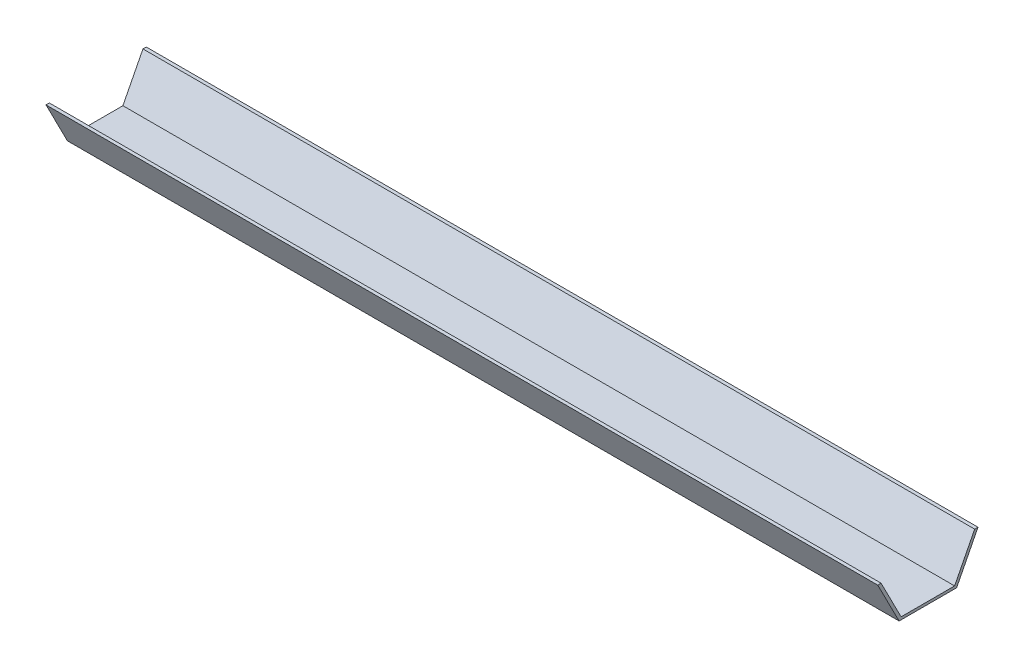
ISO-10303-21;
HEADER;
FILE_DESCRIPTION(('STEP AP214'),'2;1');
FILE_NAME('part.step','',(''),(''),'','','');
FILE_SCHEMA(('AUTOMOTIVE_DESIGN { 1 0 10303 214 1 1 1 1 }'));
ENDSEC;
DATA;
#1=APPLICATION_CONTEXT('core data for automotive mechanical design processes');
#2=APPLICATION_PROTOCOL_DEFINITION('international standard','automotive_design',2000,#1);
#3=PRODUCT_CONTEXT('',#1,'mechanical');
#4=PRODUCT('Part','Part','',(#3));
#5=PRODUCT_RELATED_PRODUCT_CATEGORY('part','',(#4));
#6=PRODUCT_DEFINITION_FORMATION('','',#4);
#7=PRODUCT_DEFINITION_CONTEXT('part definition',#1,'design');
#8=PRODUCT_DEFINITION('design','',#6,#7);
#9=PRODUCT_DEFINITION_SHAPE('','',#8);
#10=(LENGTH_UNIT() NAMED_UNIT(*) SI_UNIT(.MILLI.,.METRE.));
#11=(NAMED_UNIT(*) PLANE_ANGLE_UNIT() SI_UNIT($,.RADIAN.));
#12=(NAMED_UNIT(*) SI_UNIT($,.STERADIAN.) SOLID_ANGLE_UNIT());
#13=UNCERTAINTY_MEASURE_WITH_UNIT(LENGTH_MEASURE(1.E-05),#10,'distance_accuracy_value','');
#14=(GEOMETRIC_REPRESENTATION_CONTEXT(3) GLOBAL_UNCERTAINTY_ASSIGNED_CONTEXT((#13)) GLOBAL_UNIT_ASSIGNED_CONTEXT((#10,
#11,#12)) REPRESENTATION_CONTEXT('',''));
#15=CARTESIAN_POINT('',(0.,0.,0.));
#16=DIRECTION('',(0.,0.,1.));
#17=DIRECTION('',(1.,0.,0.));
#18=AXIS2_PLACEMENT_3D('',#15,#16,#17);
#19=CARTESIAN_POINT('',(375.,1.18733065666912,0.));
#20=DIRECTION('',(0.,1.,0.));
#21=DIRECTION('',(0.,0.,1.));
#22=AXIS2_PLACEMENT_3D('',#19,#20,#21);
#23=PLANE('',#22);
#24=DIRECTION('',(0.,0.,-1.));
#25=VECTOR('',#24,1.);
#26=CARTESIAN_POINT('',(0.,1.18733065666912,0.));
#27=LINE('',#26,#25);
#28=CARTESIAN_POINT('',(0.,1.18733065666912,23.5223602978325));
#29=VERTEX_POINT('',#28);
#30=CARTESIAN_POINT('',(0.,1.18733065666912,-0.607157722160343));
#31=VERTEX_POINT('',#30);
#32=EDGE_CURVE('E131',#29,#31,#27,.T.);
#33=ORIENTED_EDGE('',*,*,#32,.F.);
#34=DIRECTION('',(-1.,0.,0.));
#35=VECTOR('',#34,1.);
#36=CARTESIAN_POINT('',(375.,1.18733065666912,23.5223602978325));
#37=LINE('',#36,#35);
#38=CARTESIAN_POINT('',(375.,1.18733065666912,23.5223602978325));
#39=VERTEX_POINT('',#38);
#40=EDGE_CURVE('E11',#39,#29,#37,.T.);
#41=ORIENTED_EDGE('',*,*,#40,.F.);
#42=DIRECTION('',(0.,0.,-1.));
#43=VECTOR('',#42,1.);
#44=CARTESIAN_POINT('',(375.,1.18733065666912,0.));
#45=LINE('',#44,#43);
#46=CARTESIAN_POINT('',(375.,1.18733065666912,-0.607157722160343));
#47=VERTEX_POINT('',#46);
#48=EDGE_CURVE('E149',#39,#47,#45,.T.);
#49=ORIENTED_EDGE('',*,*,#48,.T.);
#50=DIRECTION('',(-1.,0.,0.));
#51=VECTOR('',#50,1.);
#52=CARTESIAN_POINT('',(375.,1.18733065666912,-0.607157722160343));
#53=LINE('',#52,#51);
#54=EDGE_CURVE('E54',#47,#31,#53,.T.);
#55=ORIENTED_EDGE('',*,*,#54,.T.);
#56=EDGE_LOOP('',(#33,#41,#49,#55));
#57=FACE_BOUND('',#56,.T.);
#58=ADVANCED_FACE('F38',(#57),#23,.T.);
#59=CARTESIAN_POINT('',(375.,-9.28899602821799,18.1651477885152));
#60=DIRECTION('',(0.,-0.455289315866723,0.89034355102826));
#61=DIRECTION('',(0.,-0.89034355102826,-0.455289315866723));
#62=AXIS2_PLACEMENT_3D('',#59,#60,#61);
#63=PLANE('',#62);
#64=DIRECTION('',(0.,0.89034355102826,0.455289315866723));
#65=VECTOR('',#64,1.);
#66=CARTESIAN_POINT('',(0.,-9.28899602821799,18.1651477885152));
#67=LINE('',#66,#65);
#68=CARTESIAN_POINT('',(0.,18.8461479127023,32.5524373037585));
#69=VERTEX_POINT('',#68);
#70=EDGE_CURVE('E133',#29,#69,#67,.T.);
#71=ORIENTED_EDGE('',*,*,#70,.T.);
#72=DIRECTION('',(-1.,0.,0.));
#73=VECTOR('',#72,1.);
#74=CARTESIAN_POINT('',(375.,18.8461479127023,32.5524373037585));
#75=LINE('',#74,#73);
#76=CARTESIAN_POINT('',(375.,18.8461479127023,32.5524373037585));
#77=VERTEX_POINT('',#76);
#78=EDGE_CURVE('E46',#77,#69,#75,.T.);
#79=ORIENTED_EDGE('',*,*,#78,.F.);
#80=DIRECTION('',(0.,0.89034355102826,0.455289315866723));
#81=VECTOR('',#80,1.);
#82=CARTESIAN_POINT('',(375.,-9.28899602821799,18.1651477885152));
#83=LINE('',#82,#81);
#84=EDGE_CURVE('E177',#39,#77,#83,.T.);
#85=ORIENTED_EDGE('',*,*,#84,.F.);
#86=ORIENTED_EDGE('',*,*,#40,.T.);
#87=EDGE_LOOP('',(#71,#79,#85,#86));
#88=FACE_BOUND('',#87,.T.);
#89=ADVANCED_FACE('F192',(#88),#63,.F.);
#90=CARTESIAN_POINT('',(375.,18.8461479127023,0.));
#91=DIRECTION('',(0.,-1.,0.));
#92=DIRECTION('',(0.,0.,-1.));
#93=AXIS2_PLACEMENT_3D('',#90,#91,#92);
#94=PLANE('',#93);
#95=DIRECTION('',(0.,0.,1.));
#96=VECTOR('',#95,1.);
#97=CARTESIAN_POINT('',(0.,18.8461479127023,0.));
#98=LINE('',#97,#96);
#99=CARTESIAN_POINT('',(0.,18.8461479127023,34.0624373037585));
#100=VERTEX_POINT('',#99);
#101=EDGE_CURVE('E135',#69,#100,#98,.T.);
#102=ORIENTED_EDGE('',*,*,#101,.T.);
#103=DIRECTION('',(-1.,0.,0.));
#104=VECTOR('',#103,1.);
#105=CARTESIAN_POINT('',(375.,18.8461479127023,34.0624373037585));
#106=LINE('',#105,#104);
#107=CARTESIAN_POINT('',(375.,18.8461479127023,34.0624373037585));
#108=VERTEX_POINT('',#107);
#109=EDGE_CURVE('E155',#108,#100,#106,.T.);
#110=ORIENTED_EDGE('',*,*,#109,.F.);
#111=DIRECTION('',(0.,0.,1.));
#112=VECTOR('',#111,1.);
#113=CARTESIAN_POINT('',(375.,18.8461479127023,0.));
#114=LINE('',#113,#112);
#115=EDGE_CURVE('E164',#77,#108,#114,.T.);
#116=ORIENTED_EDGE('',*,*,#115,.F.);
#117=ORIENTED_EDGE('',*,*,#78,.T.);
#118=EDGE_LOOP('',(#102,#110,#116,#117));
#119=FACE_BOUND('',#118,.T.);
#120=ADVANCED_FACE('F162',(#119),#94,.F.);
#121=CARTESIAN_POINT('',(375.,-9.90109552663134,19.3621423631902));
#122=DIRECTION('',(0.,0.455289315866723,-0.89034355102826));
#123=DIRECTION('',(0.,0.89034355102826,0.455289315866723));
#124=AXIS2_PLACEMENT_3D('',#121,#122,#123);
#125=PLANE('',#124);
#126=DIRECTION('',(0.,-0.89034355102826,-0.455289315866723));
#127=VECTOR('',#126,1.);
#128=CARTESIAN_POINT('',(0.,-9.90109552663134,19.3621423631902));
#129=LINE('',#128,#127);
#130=CARTESIAN_POINT('',(0.,0.,24.4252025756721));
#131=VERTEX_POINT('',#130);
#132=EDGE_CURVE('E137',#100,#131,#129,.T.);
#133=ORIENTED_EDGE('',*,*,#132,.T.);
#134=DIRECTION('',(-1.,0.,0.));
#135=VECTOR('',#134,1.);
#136=CARTESIAN_POINT('',(375.,0.,24.4252025756721));
#137=LINE('',#136,#135);
#138=CARTESIAN_POINT('',(375.,0.,24.4252025756721));
#139=VERTEX_POINT('',#138);
#140=EDGE_CURVE('E153',#139,#131,#137,.T.);
#141=ORIENTED_EDGE('',*,*,#140,.F.);
#142=DIRECTION('',(0.,-0.89034355102826,-0.455289315866723));
#143=VECTOR('',#142,1.);
#144=CARTESIAN_POINT('',(375.,-9.90109552663134,19.3621423631902));
#145=LINE('',#144,#143);
#146=EDGE_CURVE('E175',#108,#139,#145,.T.);
#147=ORIENTED_EDGE('',*,*,#146,.F.);
#148=ORIENTED_EDGE('',*,*,#109,.T.);
#149=EDGE_LOOP('',(#133,#141,#147,#148));
#150=FACE_BOUND('',#149,.T.);
#151=ADVANCED_FACE('F173',(#150),#125,.F.);
#152=CARTESIAN_POINT('',(375.,0.,0.));
#153=DIRECTION('',(0.,-1.,0.));
#154=DIRECTION('',(0.,0.,-1.));
#155=AXIS2_PLACEMENT_3D('',#152,#153,#154);
#156=PLANE('',#155);
#157=DIRECTION('',(0.,0.,1.));
#158=VECTOR('',#157,1.);
#159=CARTESIAN_POINT('',(0.,0.,0.));
#160=LINE('',#159,#158);
#161=CARTESIAN_POINT('',(0.,0.,-1.50726327538842));
#162=VERTEX_POINT('',#161);
#163=EDGE_CURVE('E140',#162,#131,#160,.T.);
#164=ORIENTED_EDGE('',*,*,#163,.F.);
#165=DIRECTION('',(-1.,0.,0.));
#166=VECTOR('',#165,1.);
#167=CARTESIAN_POINT('',(375.,0.,-1.50726327538842));
#168=LINE('',#167,#166);
#169=CARTESIAN_POINT('',(375.,0.,-1.50726327538842));
#170=VERTEX_POINT('',#169);
#171=EDGE_CURVE('E113',#170,#162,#168,.T.);
#172=ORIENTED_EDGE('',*,*,#171,.F.);
#173=DIRECTION('',(0.,0.,1.));
#174=VECTOR('',#173,1.);
#175=CARTESIAN_POINT('',(375.,0.,0.));
#176=LINE('',#175,#174);
#177=EDGE_CURVE('E123',#170,#139,#176,.T.);
#178=ORIENTED_EDGE('',*,*,#177,.T.);
#179=ORIENTED_EDGE('',*,*,#140,.T.);
#180=EDGE_LOOP('',(#164,#172,#178,#179));
#181=FACE_BOUND('',#180,.T.);
#182=ADVANCED_FACE('F203',(#181),#156,.T.);
#183=CARTESIAN_POINT('',(375.,-0.610990129034509,-1.19482514122304));
#184=DIRECTION('',(0.,-0.455289315866723,-0.89034355102826));
#185=DIRECTION('',(0.,0.89034355102826,-0.455289315866723));
#186=AXIS2_PLACEMENT_3D('',#183,#184,#185);
#187=PLANE('',#186);
#188=DIRECTION('',(0.,-0.89034355102826,0.455289315866723));
#189=VECTOR('',#188,1.);
#190=CARTESIAN_POINT('',(0.,-0.610990129034509,-1.19482514122304));
#191=LINE('',#190,#189);
#192=CARTESIAN_POINT('',(0.,18.8461479127023,-11.1444980034748));
#193=VERTEX_POINT('',#192);
#194=EDGE_CURVE('E109',#193,#162,#191,.T.);
#195=ORIENTED_EDGE('',*,*,#194,.F.);
#196=DIRECTION('',(-1.,0.,0.));
#197=VECTOR('',#196,1.);
#198=CARTESIAN_POINT('',(375.,18.8461479127023,-11.1444980034748));
#199=LINE('',#198,#197);
#200=CARTESIAN_POINT('',(375.,18.8461479127023,-11.1444980034748));
#201=VERTEX_POINT('',#200);
#202=EDGE_CURVE('E104',#201,#193,#199,.T.);
#203=ORIENTED_EDGE('',*,*,#202,.F.);
#204=DIRECTION('',(0.,-0.89034355102826,0.455289315866723));
#205=VECTOR('',#204,1.);
#206=CARTESIAN_POINT('',(375.,-0.610990129034509,-1.19482514122304));
#207=LINE('',#206,#205);
#208=EDGE_CURVE('E107',#201,#170,#207,.T.);
#209=ORIENTED_EDGE('',*,*,#208,.T.);
#210=ORIENTED_EDGE('',*,*,#171,.T.);
#211=EDGE_LOOP('',(#195,#203,#209,#210));
#212=FACE_BOUND('',#211,.T.);
#213=ADVANCED_FACE('F106',(#212),#187,.T.);
#214=CARTESIAN_POINT('',(375.,18.8461479127023,0.));
#215=DIRECTION('',(0.,1.,0.));
#216=DIRECTION('',(0.,0.,1.));
#217=AXIS2_PLACEMENT_3D('',#214,#215,#216);
#218=PLANE('',#217);
#219=DIRECTION('',(0.,0.,-1.));
#220=VECTOR('',#219,1.);
#221=CARTESIAN_POINT('',(0.,18.8461479127023,0.));
#222=LINE('',#221,#220);
#223=CARTESIAN_POINT('',(0.,18.8461479127023,-9.63723472808639));
#224=VERTEX_POINT('',#223);
#225=EDGE_CURVE('E144',#224,#193,#222,.T.);
#226=ORIENTED_EDGE('',*,*,#225,.F.);
#227=DIRECTION('',(-1.,0.,0.));
#228=VECTOR('',#227,1.);
#229=CARTESIAN_POINT('',(375.,18.8461479127023,-9.63723472808639));
#230=LINE('',#229,#228);
#231=CARTESIAN_POINT('',(375.,18.8461479127023,-9.63723472808639));
#232=VERTEX_POINT('',#231);
#233=EDGE_CURVE('E79',#232,#224,#230,.T.);
#234=ORIENTED_EDGE('',*,*,#233,.F.);
#235=DIRECTION('',(0.,0.,-1.));
#236=VECTOR('',#235,1.);
#237=CARTESIAN_POINT('',(375.,18.8461479127023,0.));
#238=LINE('',#237,#236);
#239=EDGE_CURVE('E121',#232,#201,#238,.T.);
#240=ORIENTED_EDGE('',*,*,#239,.T.);
#241=ORIENTED_EDGE('',*,*,#202,.T.);
#242=EDGE_LOOP('',(#226,#234,#240,#241));
#243=FACE_BOUND('',#242,.T.);
#244=ADVANCED_FACE('F125',(#243),#218,.T.);
#245=CARTESIAN_POINT('',(375.,0.,0.));
#246=DIRECTION('',(0.,0.455289315866723,0.89034355102826));
#247=DIRECTION('',(0.,-0.89034355102826,0.455289315866723));
#248=AXIS2_PLACEMENT_3D('',#245,#246,#247);
#249=PLANE('',#248);
#250=DIRECTION('',(0.,0.89034355102826,-0.455289315866723));
#251=VECTOR('',#250,1.);
#252=CARTESIAN_POINT('',(0.,0.,0.));
#253=LINE('',#252,#251);
#254=EDGE_CURVE('E146',#31,#224,#253,.T.);
#255=ORIENTED_EDGE('',*,*,#254,.F.);
#256=ORIENTED_EDGE('',*,*,#54,.F.);
#257=DIRECTION('',(0.,0.89034355102826,-0.455289315866723));
#258=VECTOR('',#257,1.);
#259=CARTESIAN_POINT('',(375.,0.,0.));
#260=LINE('',#259,#258);
#261=EDGE_CURVE('E126',#47,#232,#260,.T.);
#262=ORIENTED_EDGE('',*,*,#261,.T.);
#263=ORIENTED_EDGE('',*,*,#233,.T.);
#264=EDGE_LOOP('',(#255,#256,#262,#263));
#265=FACE_BOUND('',#264,.T.);
#266=ADVANCED_FACE('F181',(#265),#249,.T.);
#267=CARTESIAN_POINT('',(375.,0.,0.));
#268=DIRECTION('',(1.,0.,0.));
#269=DIRECTION('',(0.,0.,-1.));
#270=AXIS2_PLACEMENT_3D('',#267,#268,#269);
#271=PLANE('',#270);
#272=ORIENTED_EDGE('',*,*,#48,.F.);
#273=ORIENTED_EDGE('',*,*,#84,.T.);
#274=ORIENTED_EDGE('',*,*,#115,.T.);
#275=ORIENTED_EDGE('',*,*,#146,.T.);
#276=ORIENTED_EDGE('',*,*,#177,.F.);
#277=ORIENTED_EDGE('',*,*,#208,.F.);
#278=ORIENTED_EDGE('',*,*,#239,.F.);
#279=ORIENTED_EDGE('',*,*,#261,.F.);
#280=EDGE_LOOP('',(#272,#273,#274,#275,#276,#277,#278,#279));
#281=FACE_BOUND('',#280,.T.);
#282=ADVANCED_FACE('F119',(#281),#271,.T.);
#283=CARTESIAN_POINT('',(0.,0.,0.));
#284=DIRECTION('',(1.,0.,0.));
#285=DIRECTION('',(0.,0.,-1.));
#286=AXIS2_PLACEMENT_3D('',#283,#284,#285);
#287=PLANE('',#286);
#288=ORIENTED_EDGE('',*,*,#32,.T.);
#289=ORIENTED_EDGE('',*,*,#254,.T.);
#290=ORIENTED_EDGE('',*,*,#225,.T.);
#291=ORIENTED_EDGE('',*,*,#194,.T.);
#292=ORIENTED_EDGE('',*,*,#163,.T.);
#293=ORIENTED_EDGE('',*,*,#132,.F.);
#294=ORIENTED_EDGE('',*,*,#101,.F.);
#295=ORIENTED_EDGE('',*,*,#70,.F.);
#296=EDGE_LOOP('',(#288,#289,#290,#291,#292,#293,#294,#295));
#297=FACE_BOUND('',#296,.T.);
#298=ADVANCED_FACE('F169',(#297),#287,.F.);
#299=CLOSED_SHELL('',(#58,#89,#120,#151,#182,#213,#244,#266,#282,#298));
#300=MANIFOLD_SOLID_BREP('B2',#299);
#301=ADVANCED_BREP_SHAPE_REPRESENTATION('',(#18,#300),#14);
#302=SHAPE_DEFINITION_REPRESENTATION(#9,#301);
ENDSEC;
END-ISO-10303-21;
